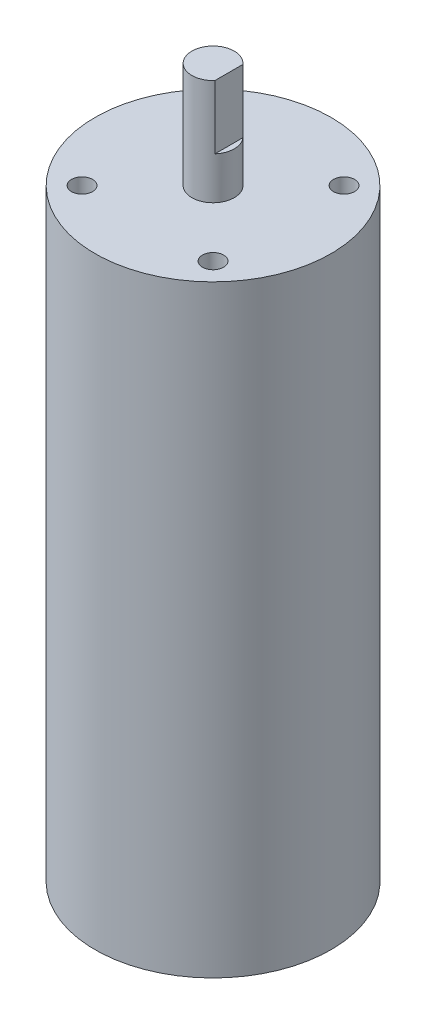
ISO-10303-21;
HEADER;
FILE_DESCRIPTION(('STEP AP214'),'2;1');
FILE_NAME('part.step','',(''),(''),'','','');
FILE_SCHEMA(('AUTOMOTIVE_DESIGN { 1 0 10303 214 1 1 1 1 }'));
ENDSEC;
DATA;
#1=APPLICATION_CONTEXT('core data for automotive mechanical design processes');
#2=APPLICATION_PROTOCOL_DEFINITION('international standard','automotive_design',2000,#1);
#3=PRODUCT_CONTEXT('',#1,'mechanical');
#4=PRODUCT('Part','Part','',(#3));
#5=PRODUCT_RELATED_PRODUCT_CATEGORY('part','',(#4));
#6=PRODUCT_DEFINITION_FORMATION('','',#4);
#7=PRODUCT_DEFINITION_CONTEXT('part definition',#1,'design');
#8=PRODUCT_DEFINITION('design','',#6,#7);
#9=PRODUCT_DEFINITION_SHAPE('','',#8);
#10=(LENGTH_UNIT() NAMED_UNIT(*) SI_UNIT(.MILLI.,.METRE.));
#11=(NAMED_UNIT(*) PLANE_ANGLE_UNIT() SI_UNIT($,.RADIAN.));
#12=(NAMED_UNIT(*) SI_UNIT($,.STERADIAN.) SOLID_ANGLE_UNIT());
#13=UNCERTAINTY_MEASURE_WITH_UNIT(LENGTH_MEASURE(1.E-05),#10,'distance_accuracy_value','');
#14=(GEOMETRIC_REPRESENTATION_CONTEXT(3) GLOBAL_UNCERTAINTY_ASSIGNED_CONTEXT((#13)) GLOBAL_UNIT_ASSIGNED_CONTEXT((#10,
#11,#12)) REPRESENTATION_CONTEXT('',''));
#15=CARTESIAN_POINT('',(0.,0.,0.));
#16=DIRECTION('',(0.,0.,1.));
#17=DIRECTION('',(1.,0.,0.));
#18=AXIS2_PLACEMENT_3D('',#15,#16,#17);
#19=CARTESIAN_POINT('',(0.,0.,0.));
#20=DIRECTION('',(0.,-1.,0.));
#21=DIRECTION('',(0.,0.,-1.));
#22=AXIS2_PLACEMENT_3D('',#19,#20,#21);
#23=PLANE('',#22);
#24=CARTESIAN_POINT('',(0.,0.,0.));
#25=DIRECTION('',(0.,-1.,0.));
#26=DIRECTION('',(0.,0.,-1.));
#27=AXIS2_PLACEMENT_3D('',#24,#25,#26);
#28=CIRCLE('',#27,22.3);
#29=CARTESIAN_POINT('',(0.,0.,-22.3));
#30=VERTEX_POINT('',#29);
#31=EDGE_CURVE('E78',#30,#30,#28,.T.);
#32=ORIENTED_EDGE('',*,*,#31,.T.);
#33=EDGE_LOOP('',(#32));
#34=FACE_BOUND('',#33,.T.);
#35=ADVANCED_FACE('F31',(#34),#23,.T.);
#36=CARTESIAN_POINT('',(0.,0.,0.));
#37=DIRECTION('',(0.,-1.,0.));
#38=DIRECTION('',(0.,0.,-1.));
#39=AXIS2_PLACEMENT_3D('',#36,#37,#38);
#40=CYLINDRICAL_SURFACE('',#39,22.3);
#41=CARTESIAN_POINT('',(0.,113.9,0.));
#42=DIRECTION('',(0.,-1.,0.));
#43=DIRECTION('',(0.,0.,-1.));
#44=AXIS2_PLACEMENT_3D('',#41,#42,#43);
#45=CIRCLE('',#44,22.3);
#46=CARTESIAN_POINT('',(0.,113.9,-22.3));
#47=VERTEX_POINT('',#46);
#48=EDGE_CURVE('E75',#47,#47,#45,.T.);
#49=ORIENTED_EDGE('',*,*,#48,.T.);
#50=EDGE_LOOP('',(#49));
#51=FACE_BOUND('',#50,.T.);
#52=ORIENTED_EDGE('',*,*,#31,.F.);
#53=EDGE_LOOP('',(#52));
#54=FACE_BOUND('',#53,.T.);
#55=ADVANCED_FACE('F83',(#51,#54),#40,.T.);
#56=CARTESIAN_POINT('',(22.3,113.9,0.));
#57=DIRECTION('',(0.,1.,0.));
#58=DIRECTION('',(0.,0.,1.));
#59=AXIS2_PLACEMENT_3D('',#56,#57,#58);
#60=PLANE('',#59);
#61=CARTESIAN_POINT('',(-12.3743686707646,113.9,12.3743686707646));
#62=DIRECTION('',(0.,1.,0.));
#63=DIRECTION('',(0.,0.,1.));
#64=AXIS2_PLACEMENT_3D('',#61,#62,#63);
#65=CIRCLE('',#64,2.);
#66=CARTESIAN_POINT('',(-12.3743686707646,113.9,14.3743686707646));
#67=VERTEX_POINT('',#66);
#68=EDGE_CURVE('E142',#67,#67,#65,.T.);
#69=ORIENTED_EDGE('',*,*,#68,.F.);
#70=EDGE_LOOP('',(#69));
#71=FACE_BOUND('',#70,.T.);
#72=CARTESIAN_POINT('',(12.3743686707646,113.9,12.3743686707646));
#73=DIRECTION('',(0.,1.,0.));
#74=DIRECTION('',(0.,0.,1.));
#75=AXIS2_PLACEMENT_3D('',#72,#73,#74);
#76=CIRCLE('',#75,2.);
#77=CARTESIAN_POINT('',(12.3743686707646,113.9,14.3743686707646));
#78=VERTEX_POINT('',#77);
#79=EDGE_CURVE('E141',#78,#78,#76,.T.);
#80=ORIENTED_EDGE('',*,*,#79,.F.);
#81=EDGE_LOOP('',(#80));
#82=FACE_BOUND('',#81,.T.);
#83=CARTESIAN_POINT('',(12.3743686707646,113.9,-12.3743686707646));
#84=DIRECTION('',(0.,1.,0.));
#85=DIRECTION('',(0.,0.,1.));
#86=AXIS2_PLACEMENT_3D('',#83,#84,#85);
#87=CIRCLE('',#86,2.);
#88=CARTESIAN_POINT('',(12.3743686707646,113.9,-10.3743686707646));
#89=VERTEX_POINT('',#88);
#90=EDGE_CURVE('E151',#89,#89,#87,.T.);
#91=ORIENTED_EDGE('',*,*,#90,.F.);
#92=EDGE_LOOP('',(#91));
#93=FACE_BOUND('',#92,.T.);
#94=CARTESIAN_POINT('',(-12.3743686707646,113.9,-12.3743686707646));
#95=DIRECTION('',(0.,1.,0.));
#96=DIRECTION('',(0.,0.,1.));
#97=AXIS2_PLACEMENT_3D('',#94,#95,#96);
#98=CIRCLE('',#97,2.);
#99=CARTESIAN_POINT('',(-12.3743686707646,113.9,-10.3743686707646));
#100=VERTEX_POINT('',#99);
#101=EDGE_CURVE('E156',#100,#100,#98,.T.);
#102=ORIENTED_EDGE('',*,*,#101,.F.);
#103=EDGE_LOOP('',(#102));
#104=FACE_BOUND('',#103,.T.);
#105=CARTESIAN_POINT('',(0.,113.9,0.));
#106=DIRECTION('',(0.,-1.,0.));
#107=DIRECTION('',(0.,0.,-1.));
#108=AXIS2_PLACEMENT_3D('',#105,#106,#107);
#109=CIRCLE('',#108,3.99999999999998);
#110=CARTESIAN_POINT('',(0.,113.9,-3.99999999999998));
#111=VERTEX_POINT('',#110);
#112=EDGE_CURVE('E69',#111,#111,#109,.T.);
#113=ORIENTED_EDGE('',*,*,#112,.T.);
#114=EDGE_LOOP('',(#113));
#115=FACE_BOUND('',#114,.T.);
#116=ORIENTED_EDGE('',*,*,#48,.F.);
#117=EDGE_LOOP('',(#116));
#118=FACE_BOUND('',#117,.T.);
#119=ADVANCED_FACE('F85',(#71,#82,#93,#104,#115,#118),#60,.T.);
#120=CARTESIAN_POINT('',(0.,0.,0.));
#121=DIRECTION('',(0.,-1.,0.));
#122=DIRECTION('',(0.,0.,-1.));
#123=AXIS2_PLACEMENT_3D('',#120,#121,#122);
#124=CYLINDRICAL_SURFACE('',#123,3.99999999999998);
#125=DIRECTION('',(0.,-1.,0.));
#126=VECTOR('',#125,1.);
#127=CARTESIAN_POINT('',(3.,0.,-2.64575131106456));
#128=LINE('',#127,#126);
#129=CARTESIAN_POINT('',(2.99999999999998,121.9,-2.64575131106456));
#130=VERTEX_POINT('',#129);
#131=CARTESIAN_POINT('',(2.99999999999998,133.9,-2.64575131106458));
#132=VERTEX_POINT('',#131);
#133=EDGE_CURVE('E45',#130,#132,#128,.F.);
#134=ORIENTED_EDGE('',*,*,#133,.F.);
#135=CARTESIAN_POINT('',(0.,121.9,0.));
#136=DIRECTION('',(0.,-1.,0.));
#137=DIRECTION('',(0.,0.,-1.));
#138=AXIS2_PLACEMENT_3D('',#135,#136,#137);
#139=CIRCLE('',#138,3.99999999999998);
#140=CARTESIAN_POINT('',(2.99999999999998,121.9,2.64575131106456));
#141=VERTEX_POINT('',#140);
#142=EDGE_CURVE('E11',#141,#130,#139,.F.);
#143=ORIENTED_EDGE('',*,*,#142,.F.);
#144=DIRECTION('',(0.,-1.,0.));
#145=VECTOR('',#144,1.);
#146=CARTESIAN_POINT('',(3.,0.,2.64575131106456));
#147=LINE('',#146,#145);
#148=CARTESIAN_POINT('',(2.99999999999998,133.9,2.64575131106458));
#149=VERTEX_POINT('',#148);
#150=EDGE_CURVE('E60',#149,#141,#147,.T.);
#151=ORIENTED_EDGE('',*,*,#150,.F.);
#152=CARTESIAN_POINT('',(0.,133.9,0.));
#153=DIRECTION('',(0.,-1.,0.));
#154=DIRECTION('',(0.,0.,-1.));
#155=AXIS2_PLACEMENT_3D('',#152,#153,#154);
#156=CIRCLE('',#155,3.99999999999998);
#157=EDGE_CURVE('E67',#149,#132,#156,.T.);
#158=ORIENTED_EDGE('',*,*,#157,.T.);
#159=EDGE_LOOP('',(#134,#143,#151,#158));
#160=FACE_BOUND('',#159,.T.);
#161=ORIENTED_EDGE('',*,*,#112,.F.);
#162=EDGE_LOOP('',(#161));
#163=FACE_BOUND('',#162,.T.);
#164=ADVANCED_FACE('F64',(#160,#163),#124,.T.);
#165=CARTESIAN_POINT('',(3.99999999999998,133.9,0.));
#166=DIRECTION('',(0.,1.,0.));
#167=DIRECTION('',(0.,0.,1.));
#168=AXIS2_PLACEMENT_3D('',#165,#166,#167);
#169=PLANE('',#168);
#170=DIRECTION('',(0.,0.,1.));
#171=VECTOR('',#170,1.);
#172=CARTESIAN_POINT('',(2.99999999999998,133.9,0.));
#173=LINE('',#172,#171);
#174=EDGE_CURVE('E38',#132,#149,#173,.T.);
#175=ORIENTED_EDGE('',*,*,#174,.F.);
#176=ORIENTED_EDGE('',*,*,#157,.F.);
#177=EDGE_LOOP('',(#175,#176));
#178=FACE_BOUND('',#177,.T.);
#179=ADVANCED_FACE('F97',(#178),#169,.T.);
#180=CARTESIAN_POINT('',(3.99999999999998,121.9,-22.3));
#181=DIRECTION('',(0.,-1.,0.));
#182=DIRECTION('',(0.,0.,-1.));
#183=AXIS2_PLACEMENT_3D('',#180,#181,#182);
#184=PLANE('',#183);
#185=ORIENTED_EDGE('',*,*,#142,.T.);
#186=DIRECTION('',(0.,0.,1.));
#187=VECTOR('',#186,1.);
#188=CARTESIAN_POINT('',(2.99999999999998,121.9,-22.3));
#189=LINE('',#188,#187);
#190=EDGE_CURVE('E57',#130,#141,#189,.T.);
#191=ORIENTED_EDGE('',*,*,#190,.T.);
#192=EDGE_LOOP('',(#185,#191));
#193=FACE_BOUND('',#192,.T.);
#194=ADVANCED_FACE('F56',(#193),#184,.F.);
#195=CARTESIAN_POINT('',(2.99999999999998,133.9,-22.3));
#196=DIRECTION('',(-1.,0.,0.));
#197=DIRECTION('',(0.,-1.,0.));
#198=AXIS2_PLACEMENT_3D('',#195,#196,#197);
#199=PLANE('',#198);
#200=ORIENTED_EDGE('',*,*,#133,.T.);
#201=ORIENTED_EDGE('',*,*,#174,.T.);
#202=ORIENTED_EDGE('',*,*,#150,.T.);
#203=ORIENTED_EDGE('',*,*,#190,.F.);
#204=EDGE_LOOP('',(#200,#201,#202,#203));
#205=FACE_BOUND('',#204,.T.);
#206=ADVANCED_FACE('F59',(#205),#199,.F.);
#207=CARTESIAN_POINT('',(-12.3743686707646,103.9,-12.3743686707646));
#208=DIRECTION('',(0.,1.,0.));
#209=DIRECTION('',(0.,0.,1.));
#210=AXIS2_PLACEMENT_3D('',#207,#208,#209);
#211=CYLINDRICAL_SURFACE('',#210,2.);
#212=CARTESIAN_POINT('',(-12.3743686707646,103.9,-12.3743686707646));
#213=DIRECTION('',(0.,1.,0.));
#214=DIRECTION('',(0.,0.,1.));
#215=AXIS2_PLACEMENT_3D('',#212,#213,#214);
#216=CIRCLE('',#215,2.);
#217=CARTESIAN_POINT('',(-12.3743686707646,103.9,-10.3743686707646));
#218=VERTEX_POINT('',#217);
#219=EDGE_CURVE('E61',#218,#218,#216,.T.);
#220=ORIENTED_EDGE('',*,*,#219,.F.);
#221=EDGE_LOOP('',(#220));
#222=FACE_BOUND('',#221,.T.);
#223=ORIENTED_EDGE('',*,*,#101,.T.);
#224=EDGE_LOOP('',(#223));
#225=FACE_BOUND('',#224,.T.);
#226=ADVANCED_FACE('F103',(#222,#225),#211,.F.);
#227=CARTESIAN_POINT('',(-12.3743686707646,103.9,-12.3743686707646));
#228=DIRECTION('',(0.,1.,0.));
#229=DIRECTION('',(0.,0.,1.));
#230=AXIS2_PLACEMENT_3D('',#227,#228,#229);
#231=PLANE('',#230);
#232=ORIENTED_EDGE('',*,*,#219,.T.);
#233=EDGE_LOOP('',(#232));
#234=FACE_BOUND('',#233,.T.);
#235=ADVANCED_FACE('F108',(#234),#231,.T.);
#236=CARTESIAN_POINT('',(12.3743686707646,103.9,-12.3743686707646));
#237=DIRECTION('',(0.,1.,0.));
#238=DIRECTION('',(0.,0.,1.));
#239=AXIS2_PLACEMENT_3D('',#236,#237,#238);
#240=CYLINDRICAL_SURFACE('',#239,2.);
#241=CARTESIAN_POINT('',(12.3743686707646,103.9,-12.3743686707646));
#242=DIRECTION('',(0.,1.,0.));
#243=DIRECTION('',(0.,0.,1.));
#244=AXIS2_PLACEMENT_3D('',#241,#242,#243);
#245=CIRCLE('',#244,2.);
#246=CARTESIAN_POINT('',(12.3743686707646,103.9,-10.3743686707646));
#247=VERTEX_POINT('',#246);
#248=EDGE_CURVE('E153',#247,#247,#245,.T.);
#249=ORIENTED_EDGE('',*,*,#248,.F.);
#250=EDGE_LOOP('',(#249));
#251=FACE_BOUND('',#250,.T.);
#252=ORIENTED_EDGE('',*,*,#90,.T.);
#253=EDGE_LOOP('',(#252));
#254=FACE_BOUND('',#253,.T.);
#255=ADVANCED_FACE('F112',(#251,#254),#240,.F.);
#256=CARTESIAN_POINT('',(12.3743686707646,103.9,-12.3743686707646));
#257=DIRECTION('',(0.,1.,0.));
#258=DIRECTION('',(0.,0.,1.));
#259=AXIS2_PLACEMENT_3D('',#256,#257,#258);
#260=PLANE('',#259);
#261=ORIENTED_EDGE('',*,*,#248,.T.);
#262=EDGE_LOOP('',(#261));
#263=FACE_BOUND('',#262,.T.);
#264=ADVANCED_FACE('F116',(#263),#260,.T.);
#265=CARTESIAN_POINT('',(12.3743686707646,103.9,12.3743686707646));
#266=DIRECTION('',(0.,1.,0.));
#267=DIRECTION('',(0.,0.,1.));
#268=AXIS2_PLACEMENT_3D('',#265,#266,#267);
#269=CYLINDRICAL_SURFACE('',#268,2.);
#270=CARTESIAN_POINT('',(12.3743686707646,103.9,12.3743686707646));
#271=DIRECTION('',(0.,1.,0.));
#272=DIRECTION('',(0.,0.,1.));
#273=AXIS2_PLACEMENT_3D('',#270,#271,#272);
#274=CIRCLE('',#273,2.);
#275=CARTESIAN_POINT('',(12.3743686707646,103.9,14.3743686707646));
#276=VERTEX_POINT('',#275);
#277=EDGE_CURVE('E145',#276,#276,#274,.T.);
#278=ORIENTED_EDGE('',*,*,#277,.F.);
#279=EDGE_LOOP('',(#278));
#280=FACE_BOUND('',#279,.T.);
#281=ORIENTED_EDGE('',*,*,#79,.T.);
#282=EDGE_LOOP('',(#281));
#283=FACE_BOUND('',#282,.T.);
#284=ADVANCED_FACE('F120',(#280,#283),#269,.F.);
#285=CARTESIAN_POINT('',(12.3743686707646,103.9,12.3743686707646));
#286=DIRECTION('',(0.,1.,0.));
#287=DIRECTION('',(0.,0.,1.));
#288=AXIS2_PLACEMENT_3D('',#285,#286,#287);
#289=PLANE('',#288);
#290=ORIENTED_EDGE('',*,*,#277,.T.);
#291=EDGE_LOOP('',(#290));
#292=FACE_BOUND('',#291,.T.);
#293=ADVANCED_FACE('F124',(#292),#289,.T.);
#294=CARTESIAN_POINT('',(-12.3743686707646,103.9,12.3743686707646));
#295=DIRECTION('',(0.,1.,0.));
#296=DIRECTION('',(0.,0.,1.));
#297=AXIS2_PLACEMENT_3D('',#294,#295,#296);
#298=CYLINDRICAL_SURFACE('',#297,2.);
#299=CARTESIAN_POINT('',(-12.3743686707646,103.9,12.3743686707646));
#300=DIRECTION('',(0.,1.,0.));
#301=DIRECTION('',(0.,0.,1.));
#302=AXIS2_PLACEMENT_3D('',#299,#300,#301);
#303=CIRCLE('',#302,2.);
#304=CARTESIAN_POINT('',(-12.3743686707646,103.9,14.3743686707646));
#305=VERTEX_POINT('',#304);
#306=EDGE_CURVE('E140',#305,#305,#303,.T.);
#307=ORIENTED_EDGE('',*,*,#306,.F.);
#308=EDGE_LOOP('',(#307));
#309=FACE_BOUND('',#308,.T.);
#310=ORIENTED_EDGE('',*,*,#68,.T.);
#311=EDGE_LOOP('',(#310));
#312=FACE_BOUND('',#311,.T.);
#313=ADVANCED_FACE('F128',(#309,#312),#298,.F.);
#314=CARTESIAN_POINT('',(-12.3743686707646,103.9,12.3743686707646));
#315=DIRECTION('',(0.,1.,0.));
#316=DIRECTION('',(0.,0.,1.));
#317=AXIS2_PLACEMENT_3D('',#314,#315,#316);
#318=PLANE('',#317);
#319=ORIENTED_EDGE('',*,*,#306,.T.);
#320=EDGE_LOOP('',(#319));
#321=FACE_BOUND('',#320,.T.);
#322=ADVANCED_FACE('F132',(#321),#318,.T.);
#323=CLOSED_SHELL('',(#35,#55,#119,#164,#179,#194,#206,#226,#235,#255,#264,#284,#293,#313,#322));
#324=MANIFOLD_SOLID_BREP('B2',#323);
#325=ADVANCED_BREP_SHAPE_REPRESENTATION('',(#18,#324),#14);
#326=SHAPE_DEFINITION_REPRESENTATION(#9,#325);
ENDSEC;
END-ISO-10303-21;
